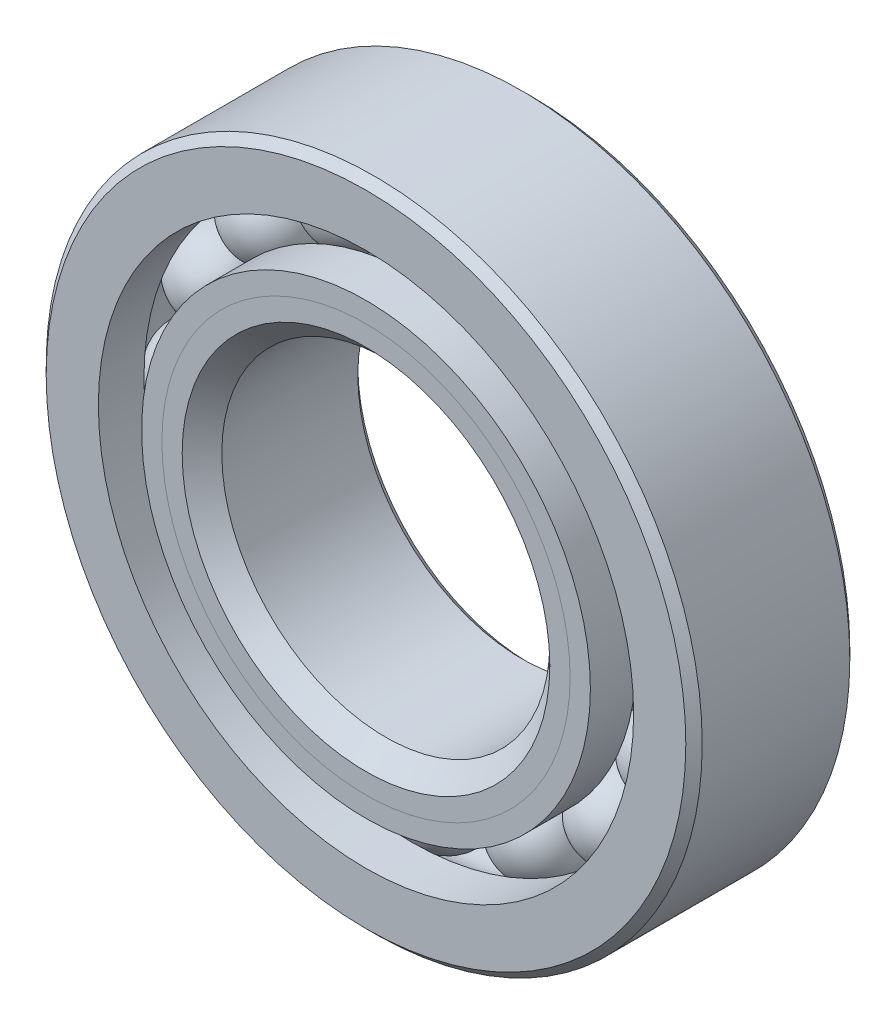
ISO-10303-21;
HEADER;
FILE_DESCRIPTION(('STEP AP214'),'2;1');
FILE_NAME('part.step','',(''),(''),'','','');
FILE_SCHEMA(('AUTOMOTIVE_DESIGN { 1 0 10303 214 1 1 1 1 }'));
ENDSEC;
DATA;
#1=APPLICATION_CONTEXT('core data for automotive mechanical design processes');
#2=APPLICATION_PROTOCOL_DEFINITION('international standard','automotive_design',2000,#1);
#3=PRODUCT_CONTEXT('',#1,'mechanical');
#4=PRODUCT('Part','Part','',(#3));
#5=PRODUCT_RELATED_PRODUCT_CATEGORY('part','',(#4));
#6=PRODUCT_DEFINITION_FORMATION('','',#4);
#7=PRODUCT_DEFINITION_CONTEXT('part definition',#1,'design');
#8=PRODUCT_DEFINITION('design','',#6,#7);
#9=PRODUCT_DEFINITION_SHAPE('','',#8);
#10=(LENGTH_UNIT() NAMED_UNIT(*) SI_UNIT(.MILLI.,.METRE.));
#11=(NAMED_UNIT(*) PLANE_ANGLE_UNIT() SI_UNIT($,.RADIAN.));
#12=(NAMED_UNIT(*) SI_UNIT($,.STERADIAN.) SOLID_ANGLE_UNIT());
#13=UNCERTAINTY_MEASURE_WITH_UNIT(LENGTH_MEASURE(1.E-05),#10,'distance_accuracy_value','');
#14=(GEOMETRIC_REPRESENTATION_CONTEXT(3) GLOBAL_UNCERTAINTY_ASSIGNED_CONTEXT((#13)) GLOBAL_UNIT_ASSIGNED_CONTEXT((#10,
#11,#12)) REPRESENTATION_CONTEXT('',''));
#15=CARTESIAN_POINT('',(0.,0.,0.));
#16=DIRECTION('',(0.,0.,1.));
#17=DIRECTION('',(1.,0.,0.));
#18=AXIS2_PLACEMENT_3D('',#15,#16,#17);
#19=CARTESIAN_POINT('',(-1.82252984663868,4.39997627358503,0.));
#20=DIRECTION('',(0.,0.,1.));
#21=DIRECTION('',(-0.382683432365077,0.923879532511292,0.));
#22=AXIS2_PLACEMENT_3D('',#19,#20,#21);
#23=SPHERICAL_SURFACE('',#22,0.820428356767388);
#24=CARTESIAN_POINT('',(-1.82252984663868,4.39997627358503,0.820428356767387));
#25=VERTEX_POINT('',#24);
#26=VERTEX_LOOP('',#25);
#27=FACE_BOUND('',#26,.T.);
#28=ADVANCED_FACE('F37',(#27),#23,.T.);
#29=CLOSED_SHELL('',(#28));
#30=MANIFOLD_SOLID_BREP('B2',#29);
#31=CARTESIAN_POINT('',(-3.36759604540089,3.36759604540097,0.));
#32=DIRECTION('',(0.,0.,1.));
#33=DIRECTION('',(-0.707106781186539,0.707106781186556,0.));
#34=AXIS2_PLACEMENT_3D('',#31,#32,#33);
#35=SPHERICAL_SURFACE('',#34,0.820428356767388);
#36=CARTESIAN_POINT('',(-3.36759604540089,3.36759604540097,0.820428356767387));
#37=VERTEX_POINT('',#36);
#38=VERTEX_LOOP('',#37);
#39=FACE_BOUND('',#38,.T.);
#40=ADVANCED_FACE('F57',(#39),#35,.T.);
#41=CLOSED_SHELL('',(#40));
#42=MANIFOLD_SOLID_BREP('B6',#41);
#43=CARTESIAN_POINT('',(-4.39997627358498,1.82252984663879,0.));
#44=DIRECTION('',(0.,0.,1.));
#45=DIRECTION('',(-0.923879532511283,0.3826834323651,0.));
#46=AXIS2_PLACEMENT_3D('',#43,#44,#45);
#47=SPHERICAL_SURFACE('',#46,0.820428356767388);
#48=CARTESIAN_POINT('',(-4.39997627358498,1.82252984663879,0.820428356767387));
#49=VERTEX_POINT('',#48);
#50=VERTEX_LOOP('',#49);
#51=FACE_BOUND('',#50,.T.);
#52=ADVANCED_FACE('F77',(#51),#47,.T.);
#53=CLOSED_SHELL('',(#52));
#54=MANIFOLD_SOLID_BREP('B33',#53);
#55=CARTESIAN_POINT('',(-4.7625,0.,0.));
#56=DIRECTION('',(0.,0.,1.));
#57=DIRECTION('',(-1.,0.,0.));
#58=AXIS2_PLACEMENT_3D('',#55,#56,#57);
#59=SPHERICAL_SURFACE('',#58,0.820428356767388);
#60=CARTESIAN_POINT('',(-4.7625,0.,0.820428356767387));
#61=VERTEX_POINT('',#60);
#62=VERTEX_LOOP('',#61);
#63=FACE_BOUND('',#62,.T.);
#64=ADVANCED_FACE('F97',(#63),#59,.T.);
#65=CLOSED_SHELL('',(#64));
#66=MANIFOLD_SOLID_BREP('B53',#65);
#67=CARTESIAN_POINT('',(-4.39997627358502,-1.8225298466387,0.));
#68=DIRECTION('',(0.,0.,1.));
#69=DIRECTION('',(-0.923879532511291,-0.382683432365081,0.));
#70=AXIS2_PLACEMENT_3D('',#67,#68,#69);
#71=SPHERICAL_SURFACE('',#70,0.820428356767388);
#72=CARTESIAN_POINT('',(-4.39997627358502,-1.8225298466387,0.820428356767387));
#73=VERTEX_POINT('',#72);
#74=VERTEX_LOOP('',#73);
#75=FACE_BOUND('',#74,.T.);
#76=ADVANCED_FACE('F119',(#75),#71,.T.);
#77=CLOSED_SHELL('',(#76));
#78=MANIFOLD_SOLID_BREP('B73',#77);
#79=CARTESIAN_POINT('',(-3.36759604540096,-3.3675960454009,0.));
#80=DIRECTION('',(0.,0.,1.));
#81=DIRECTION('',(-0.707106781186554,-0.707106781186541,0.));
#82=AXIS2_PLACEMENT_3D('',#79,#80,#81);
#83=SPHERICAL_SURFACE('',#82,0.820428356767388);
#84=CARTESIAN_POINT('',(-3.36759604540096,-3.3675960454009,0.820428356767387));
#85=VERTEX_POINT('',#84);
#86=VERTEX_LOOP('',#85);
#87=FACE_BOUND('',#86,.T.);
#88=ADVANCED_FACE('F140',(#87),#83,.T.);
#89=CLOSED_SHELL('',(#88));
#90=MANIFOLD_SOLID_BREP('B93',#89);
#91=CARTESIAN_POINT('',(-1.82252984663877,-4.39997627358499,0.));
#92=DIRECTION('',(0.,0.,1.));
#93=DIRECTION('',(-0.382683432365097,-0.923879532511284,0.));
#94=AXIS2_PLACEMENT_3D('',#91,#92,#93);
#95=SPHERICAL_SURFACE('',#94,0.820428356767388);
#96=CARTESIAN_POINT('',(-1.82252984663877,-4.39997627358499,0.820428356767387));
#97=VERTEX_POINT('',#96);
#98=VERTEX_LOOP('',#97);
#99=FACE_BOUND('',#98,.T.);
#100=ADVANCED_FACE('F161',(#99),#95,.T.);
#101=CLOSED_SHELL('',(#100));
#102=MANIFOLD_SOLID_BREP('B115',#101);
#103=CARTESIAN_POINT('',(0.,-4.7625,0.));
#104=DIRECTION('',(0.,0.,1.));
#105=DIRECTION('',(0.,-1.,0.));
#106=AXIS2_PLACEMENT_3D('',#103,#104,#105);
#107=SPHERICAL_SURFACE('',#106,0.820428356767388);
#108=CARTESIAN_POINT('',(0.,-4.7625,0.820428356767387));
#109=VERTEX_POINT('',#108);
#110=VERTEX_LOOP('',#109);
#111=FACE_BOUND('',#110,.T.);
#112=ADVANCED_FACE('F182',(#111),#107,.T.);
#113=CLOSED_SHELL('',(#112));
#114=MANIFOLD_SOLID_BREP('B136',#113);
#115=CARTESIAN_POINT('',(1.82252984663871,-4.39997627358501,0.));
#116=DIRECTION('',(0.,0.,1.));
#117=DIRECTION('',(0.382683432365084,-0.923879532511289,0.));
#118=AXIS2_PLACEMENT_3D('',#115,#116,#117);
#119=SPHERICAL_SURFACE('',#118,0.820428356767388);
#120=CARTESIAN_POINT('',(1.82252984663871,-4.39997627358501,0.820428356767387));
#121=VERTEX_POINT('',#120);
#122=VERTEX_LOOP('',#121);
#123=FACE_BOUND('',#122,.T.);
#124=ADVANCED_FACE('F203',(#123),#119,.T.);
#125=CLOSED_SHELL('',(#124));
#126=MANIFOLD_SOLID_BREP('B157',#125);
#127=CARTESIAN_POINT('',(3.36759604540091,-3.36759604540095,0.));
#128=DIRECTION('',(0.,0.,1.));
#129=DIRECTION('',(0.707106781186544,-0.707106781186551,0.));
#130=AXIS2_PLACEMENT_3D('',#127,#128,#129);
#131=SPHERICAL_SURFACE('',#130,0.820428356767388);
#132=CARTESIAN_POINT('',(3.36759604540091,-3.36759604540095,0.820428356767387));
#133=VERTEX_POINT('',#132);
#134=VERTEX_LOOP('',#133);
#135=FACE_BOUND('',#134,.T.);
#136=ADVANCED_FACE('F224',(#135),#131,.T.);
#137=CLOSED_SHELL('',(#136));
#138=MANIFOLD_SOLID_BREP('B178',#137);
#139=CARTESIAN_POINT('',(4.399976273585,-1.82252984663876,0.));
#140=DIRECTION('',(0.,0.,1.));
#141=DIRECTION('',(0.923879532511285,-0.382683432365094,0.));
#142=AXIS2_PLACEMENT_3D('',#139,#140,#141);
#143=SPHERICAL_SURFACE('',#142,0.820428356767388);
#144=CARTESIAN_POINT('',(4.399976273585,-1.82252984663876,0.820428356767387));
#145=VERTEX_POINT('',#144);
#146=VERTEX_LOOP('',#145);
#147=FACE_BOUND('',#146,.T.);
#148=ADVANCED_FACE('F245',(#147),#143,.T.);
#149=CLOSED_SHELL('',(#148));
#150=MANIFOLD_SOLID_BREP('B199',#149);
#151=CARTESIAN_POINT('',(4.7625,0.,0.));
#152=DIRECTION('',(0.,0.,1.));
#153=DIRECTION('',(1.,0.,0.));
#154=AXIS2_PLACEMENT_3D('',#151,#152,#153);
#155=SPHERICAL_SURFACE('',#154,0.820428356767388);
#156=CARTESIAN_POINT('',(4.7625,0.,0.820428356767387));
#157=VERTEX_POINT('',#156);
#158=VERTEX_LOOP('',#157);
#159=FACE_BOUND('',#158,.T.);
#160=ADVANCED_FACE('F266',(#159),#155,.T.);
#161=CLOSED_SHELL('',(#160));
#162=MANIFOLD_SOLID_BREP('B220',#161);
#163=CARTESIAN_POINT('',(4.39997627358501,1.82252984663873,0.));
#164=DIRECTION('',(0.,0.,1.));
#165=DIRECTION('',(0.923879532511288,0.382683432365087,0.));
#166=AXIS2_PLACEMENT_3D('',#163,#164,#165);
#167=SPHERICAL_SURFACE('',#166,0.820428356767388);
#168=CARTESIAN_POINT('',(4.39997627358501,1.82252984663873,0.820428356767387));
#169=VERTEX_POINT('',#168);
#170=VERTEX_LOOP('',#169);
#171=FACE_BOUND('',#170,.T.);
#172=ADVANCED_FACE('F287',(#171),#167,.T.);
#173=CLOSED_SHELL('',(#172));
#174=MANIFOLD_SOLID_BREP('B241',#173);
#175=CARTESIAN_POINT('',(3.36759604540094,3.36759604540093,0.));
#176=DIRECTION('',(0.,0.,1.));
#177=DIRECTION('',(0.707106781186549,0.707106781186546,0.));
#178=AXIS2_PLACEMENT_3D('',#175,#176,#177);
#179=SPHERICAL_SURFACE('',#178,0.820428356767388);
#180=CARTESIAN_POINT('',(3.36759604540094,3.36759604540093,0.820428356767387));
#181=VERTEX_POINT('',#180);
#182=VERTEX_LOOP('',#181);
#183=FACE_BOUND('',#182,.T.);
#184=ADVANCED_FACE('F308',(#183),#179,.T.);
#185=CLOSED_SHELL('',(#184));
#186=MANIFOLD_SOLID_BREP('B262',#185);
#187=CARTESIAN_POINT('',(1.82252984663874,4.399976273585,0.));
#188=DIRECTION('',(0.,0.,1.));
#189=DIRECTION('',(0.382683432365091,0.923879532511287,0.));
#190=AXIS2_PLACEMENT_3D('',#187,#188,#189);
#191=SPHERICAL_SURFACE('',#190,0.820428356767388);
#192=CARTESIAN_POINT('',(1.82252984663874,4.399976273585,0.820428356767387));
#193=VERTEX_POINT('',#192);
#194=VERTEX_LOOP('',#193);
#195=FACE_BOUND('',#194,.T.);
#196=ADVANCED_FACE('F329',(#195),#191,.T.);
#197=CLOSED_SHELL('',(#196));
#198=MANIFOLD_SOLID_BREP('B283',#197);
#199=CARTESIAN_POINT('',(0.,4.7625,0.));
#200=DIRECTION('',(0.,0.,1.));
#201=DIRECTION('',(0.,1.,0.));
#202=AXIS2_PLACEMENT_3D('',#199,#200,#201);
#203=SPHERICAL_SURFACE('',#202,0.820428356767388);
#204=CARTESIAN_POINT('',(0.,4.7625,0.820428356767387));
#205=VERTEX_POINT('',#204);
#206=VERTEX_LOOP('',#205);
#207=FACE_BOUND('',#206,.T.);
#208=ADVANCED_FACE('F351',(#207),#203,.T.);
#209=CLOSED_SHELL('',(#208));
#210=MANIFOLD_SOLID_BREP('B304',#209);
#211=CARTESIAN_POINT('',(0.,3.95117725146749,1.5875));
#212=DIRECTION('',(0.,0.,-1.));
#213=DIRECTION('',(-1.,0.,0.));
#214=AXIS2_PLACEMENT_3D('',#211,#212,#213);
#215=PLANE('',#214);
#216=CARTESIAN_POINT('',(0.,0.,1.5875));
#217=DIRECTION('',(0.,0.,1.));
#218=DIRECTION('',(1.,0.,0.));
#219=AXIS2_PLACEMENT_3D('',#216,#217,#218);
#220=CIRCLE('',#219,3.55853582161631);
#221=CARTESIAN_POINT('',(3.55853582161631,0.,1.5875));
#222=VERTEX_POINT('',#221);
#223=EDGE_CURVE('E406',#222,#222,#220,.T.);
#224=ORIENTED_EDGE('',*,*,#223,.F.);
#225=EDGE_LOOP('',(#224));
#226=FACE_BOUND('',#225,.T.);
#227=CARTESIAN_POINT('',(0.,0.,1.5875));
#228=DIRECTION('',(0.,0.,1.));
#229=DIRECTION('',(1.,0.,0.));
#230=AXIS2_PLACEMENT_3D('',#227,#228,#229);
#231=CIRCLE('',#230,3.95117725146749);
#232=CARTESIAN_POINT('',(3.95117725146749,0.,1.5875));
#233=VERTEX_POINT('',#232);
#234=EDGE_CURVE('E350',#233,#233,#231,.T.);
#235=ORIENTED_EDGE('',*,*,#234,.T.);
#236=EDGE_LOOP('',(#235));
#237=FACE_BOUND('',#236,.T.);
#238=ADVANCED_FACE('F372',(#226,#237),#215,.F.);
#239=CARTESIAN_POINT('',(0.,0.,1.19485857014881));
#240=DIRECTION('',(0.,0.,1.));
#241=DIRECTION('',(1.,0.,0.));
#242=AXIS2_PLACEMENT_3D('',#239,#240,#241);
#243=CONICAL_SURFACE('',#242,3.55853582161631,0.78539816339745);
#244=ORIENTED_EDGE('',*,*,#234,.F.);
#245=EDGE_LOOP('',(#244));
#246=FACE_BOUND('',#245,.T.);
#247=CARTESIAN_POINT('',(0.,0.,1.19485857014881));
#248=DIRECTION('',(0.,0.,1.));
#249=DIRECTION('',(1.,0.,0.));
#250=AXIS2_PLACEMENT_3D('',#247,#248,#249);
#251=CIRCLE('',#250,3.55853582161631);
#252=CARTESIAN_POINT('',(3.55853582161631,0.,1.19485857014881));
#253=VERTEX_POINT('',#252);
#254=EDGE_CURVE('E378',#253,#253,#251,.T.);
#255=ORIENTED_EDGE('',*,*,#254,.T.);
#256=EDGE_LOOP('',(#255));
#257=FACE_BOUND('',#256,.T.);
#258=ADVANCED_FACE('F413',(#246,#257),#243,.T.);
#259=CARTESIAN_POINT('',(0.,0.,1.5875));
#260=DIRECTION('',(0.,0.,1.));
#261=DIRECTION('',(1.,0.,0.));
#262=AXIS2_PLACEMENT_3D('',#259,#260,#261);
#263=CYLINDRICAL_SURFACE('',#262,3.55853582161631);
#264=ORIENTED_EDGE('',*,*,#254,.F.);
#265=EDGE_LOOP('',(#264));
#266=FACE_BOUND('',#265,.T.);
#267=CARTESIAN_POINT('',(0.,0.,0.));
#268=DIRECTION('',(0.,0.,1.));
#269=DIRECTION('',(1.,0.,0.));
#270=AXIS2_PLACEMENT_3D('',#267,#268,#269);
#271=CIRCLE('',#270,3.55853582161631);
#272=CARTESIAN_POINT('',(3.55853582161631,0.,0.));
#273=VERTEX_POINT('',#272);
#274=EDGE_CURVE('E382',#273,#273,#271,.T.);
#275=ORIENTED_EDGE('',*,*,#274,.T.);
#276=EDGE_LOOP('',(#275));
#277=FACE_BOUND('',#276,.T.);
#278=ADVANCED_FACE('F417',(#266,#277),#263,.T.);
#279=CARTESIAN_POINT('',(0.,3.55853582161631,0.));
#280=DIRECTION('',(0.,0.,-1.));
#281=DIRECTION('',(-1.,0.,0.));
#282=AXIS2_PLACEMENT_3D('',#279,#280,#281);
#283=PLANE('',#282);
#284=ORIENTED_EDGE('',*,*,#274,.F.);
#285=EDGE_LOOP('',(#284));
#286=FACE_BOUND('',#285,.T.);
#287=CARTESIAN_POINT('',(0.,0.,0.));
#288=DIRECTION('',(0.,0.,1.));
#289=DIRECTION('',(1.,0.,0.));
#290=AXIS2_PLACEMENT_3D('',#287,#288,#289);
#291=CIRCLE('',#290,3.94207164323261);
#292=CARTESIAN_POINT('',(3.94207164323261,0.,0.));
#293=VERTEX_POINT('',#292);
#294=EDGE_CURVE('E386',#293,#293,#291,.T.);
#295=ORIENTED_EDGE('',*,*,#294,.T.);
#296=EDGE_LOOP('',(#295));
#297=FACE_BOUND('',#296,.T.);
#298=ADVANCED_FACE('F422',(#286,#297),#283,.F.);
#299=CARTESIAN_POINT('',(0.,0.,0.));
#300=DIRECTION('',(0.,0.,1.));
#301=DIRECTION('',(1.,0.,0.));
#302=AXIS2_PLACEMENT_3D('',#299,#300,#301);
#303=TOROIDAL_SURFACE('',#302,4.7625,0.820428356767388);
#304=ORIENTED_EDGE('',*,*,#294,.F.);
#305=EDGE_LOOP('',(#304));
#306=FACE_BOUND('',#305,.T.);
#307=CARTESIAN_POINT('',(0.,0.,-0.705555555555556));
#308=DIRECTION('',(0.,0.,1.));
#309=DIRECTION('',(1.,0.,0.));
#310=AXIS2_PLACEMENT_3D('',#307,#308,#309);
#311=CIRCLE('',#310,4.34381868131868);
#312=CARTESIAN_POINT('',(4.34381868131868,0.,-0.705555555555556));
#313=VERTEX_POINT('',#312);
#314=EDGE_CURVE('E391',#313,#313,#311,.T.);
#315=ORIENTED_EDGE('',*,*,#314,.T.);
#316=EDGE_LOOP('',(#315));
#317=FACE_BOUND('',#316,.T.);
#318=ADVANCED_FACE('F428',(#306,#317),#303,.F.);
#319=CARTESIAN_POINT('',(0.,0.,1.5875));
#320=DIRECTION('',(0.,0.,1.));
#321=DIRECTION('',(1.,0.,0.));
#322=AXIS2_PLACEMENT_3D('',#319,#320,#321);
#323=CYLINDRICAL_SURFACE('',#322,4.34381868131868);
#324=ORIENTED_EDGE('',*,*,#314,.F.);
#325=EDGE_LOOP('',(#324));
#326=FACE_BOUND('',#325,.T.);
#327=CARTESIAN_POINT('',(0.,0.,-1.5875));
#328=DIRECTION('',(0.,0.,1.));
#329=DIRECTION('',(1.,0.,0.));
#330=AXIS2_PLACEMENT_3D('',#327,#328,#329);
#331=CIRCLE('',#330,4.34381868131868);
#332=CARTESIAN_POINT('',(4.34381868131868,0.,-1.5875));
#333=VERTEX_POINT('',#332);
#334=EDGE_CURVE('E394',#333,#333,#331,.T.);
#335=ORIENTED_EDGE('',*,*,#334,.T.);
#336=EDGE_LOOP('',(#335));
#337=FACE_BOUND('',#336,.T.);
#338=ADVANCED_FACE('F432',(#326,#337),#323,.T.);
#339=CARTESIAN_POINT('',(0.,3.33375,-1.5875));
#340=DIRECTION('',(0.,0.,1.));
#341=DIRECTION('',(1.,0.,0.));
#342=AXIS2_PLACEMENT_3D('',#339,#340,#341);
#343=PLANE('',#342);
#344=ORIENTED_EDGE('',*,*,#334,.F.);
#345=EDGE_LOOP('',(#344));
#346=FACE_BOUND('',#345,.T.);
#347=CARTESIAN_POINT('',(0.,0.,-1.5875));
#348=DIRECTION('',(0.,0.,1.));
#349=DIRECTION('',(1.,0.,0.));
#350=AXIS2_PLACEMENT_3D('',#347,#348,#349);
#351=CIRCLE('',#350,3.33375);
#352=CARTESIAN_POINT('',(3.33375,0.,-1.5875));
#353=VERTEX_POINT('',#352);
#354=EDGE_CURVE('E397',#353,#353,#351,.T.);
#355=ORIENTED_EDGE('',*,*,#354,.T.);
#356=EDGE_LOOP('',(#355));
#357=FACE_BOUND('',#356,.T.);
#358=ADVANCED_FACE('F436',(#346,#357),#343,.F.);
#359=CARTESIAN_POINT('',(0.,0.,-1.42875));
#360=DIRECTION('',(0.,0.,-1.));
#361=DIRECTION('',(-1.,0.,0.));
#362=AXIS2_PLACEMENT_3D('',#359,#360,#361);
#363=CONICAL_SURFACE('',#362,3.175,0.785398163397448);
#364=ORIENTED_EDGE('',*,*,#354,.F.);
#365=EDGE_LOOP('',(#364));
#366=FACE_BOUND('',#365,.T.);
#367=CARTESIAN_POINT('',(0.,0.,-1.42875));
#368=DIRECTION('',(0.,0.,1.));
#369=DIRECTION('',(1.,0.,0.));
#370=AXIS2_PLACEMENT_3D('',#367,#368,#369);
#371=CIRCLE('',#370,3.175);
#372=CARTESIAN_POINT('',(3.175,0.,-1.42875));
#373=VERTEX_POINT('',#372);
#374=EDGE_CURVE('E400',#373,#373,#371,.T.);
#375=ORIENTED_EDGE('',*,*,#374,.T.);
#376=EDGE_LOOP('',(#375));
#377=FACE_BOUND('',#376,.T.);
#378=ADVANCED_FACE('F440',(#366,#377),#363,.F.);
#379=CARTESIAN_POINT('',(0.,0.,1.5875));
#380=DIRECTION('',(0.,0.,1.));
#381=DIRECTION('',(1.,0.,0.));
#382=AXIS2_PLACEMENT_3D('',#379,#380,#381);
#383=CYLINDRICAL_SURFACE('',#382,3.175);
#384=ORIENTED_EDGE('',*,*,#374,.F.);
#385=EDGE_LOOP('',(#384));
#386=FACE_BOUND('',#385,.T.);
#387=CARTESIAN_POINT('',(0.,0.,1.2039641783837));
#388=DIRECTION('',(0.,0.,1.));
#389=DIRECTION('',(1.,0.,0.));
#390=AXIS2_PLACEMENT_3D('',#387,#388,#389);
#391=CIRCLE('',#390,3.175);
#392=CARTESIAN_POINT('',(3.175,0.,1.2039641783837));
#393=VERTEX_POINT('',#392);
#394=EDGE_CURVE('E403',#393,#393,#391,.T.);
#395=ORIENTED_EDGE('',*,*,#394,.T.);
#396=EDGE_LOOP('',(#395));
#397=FACE_BOUND('',#396,.T.);
#398=ADVANCED_FACE('F444',(#386,#397),#383,.F.);
#399=CARTESIAN_POINT('',(0.,0.,1.5875));
#400=DIRECTION('',(0.,0.,1.));
#401=DIRECTION('',(1.,0.,0.));
#402=AXIS2_PLACEMENT_3D('',#399,#400,#401);
#403=CONICAL_SURFACE('',#402,3.55853582161631,0.78539816339745);
#404=ORIENTED_EDGE('',*,*,#394,.F.);
#405=EDGE_LOOP('',(#404));
#406=FACE_BOUND('',#405,.T.);
#407=ORIENTED_EDGE('',*,*,#223,.T.);
#408=EDGE_LOOP('',(#407));
#409=FACE_BOUND('',#408,.T.);
#410=ADVANCED_FACE('F410',(#406,#409),#403,.F.);
#411=CLOSED_SHELL('',(#238,#258,#278,#298,#318,#338,#358,#378,#398,#410));
#412=MANIFOLD_SOLID_BREP('B325',#411);
#413=CARTESIAN_POINT('',(0.,4.34381868131868,1.5875));
#414=DIRECTION('',(0.,0.,-1.));
#415=DIRECTION('',(-1.,0.,0.));
#416=AXIS2_PLACEMENT_3D('',#413,#414,#415);
#417=PLANE('',#416);
#418=CARTESIAN_POINT('',(0.,0.,1.5875));
#419=DIRECTION('',(0.,0.,1.));
#420=DIRECTION('',(1.,0.,0.));
#421=AXIS2_PLACEMENT_3D('',#418,#419,#420);
#422=CIRCLE('',#421,3.95117725146749);
#423=CARTESIAN_POINT('',(3.95117725146749,0.,1.5875));
#424=VERTEX_POINT('',#423);
#425=EDGE_CURVE('E371',#424,#424,#422,.T.);
#426=ORIENTED_EDGE('',*,*,#425,.F.);
#427=EDGE_LOOP('',(#426));
#428=FACE_BOUND('',#427,.T.);
#429=CARTESIAN_POINT('',(0.,0.,1.5875));
#430=DIRECTION('',(0.,0.,1.));
#431=DIRECTION('',(1.,0.,0.));
#432=AXIS2_PLACEMENT_3D('',#429,#430,#431);
#433=CIRCLE('',#432,4.34381868131868);
#434=CARTESIAN_POINT('',(4.34381868131868,0.,1.5875));
#435=VERTEX_POINT('',#434);
#436=EDGE_CURVE('E553',#435,#435,#433,.T.);
#437=ORIENTED_EDGE('',*,*,#436,.T.);
#438=EDGE_LOOP('',(#437));
#439=FACE_BOUND('',#438,.T.);
#440=ADVANCED_FACE('F531',(#428,#439),#417,.F.);
#441=CARTESIAN_POINT('',(0.,0.,1.5875));
#442=DIRECTION('',(0.,0.,1.));
#443=DIRECTION('',(1.,0.,0.));
#444=AXIS2_PLACEMENT_3D('',#441,#442,#443);
#445=CONICAL_SURFACE('',#444,3.95117725146749,0.78539816339745);
#446=CARTESIAN_POINT('',(0.,0.,1.19485857014881));
#447=DIRECTION('',(0.,0.,1.));
#448=DIRECTION('',(1.,0.,0.));
#449=AXIS2_PLACEMENT_3D('',#446,#447,#448);
#450=CIRCLE('',#449,3.55853582161631);
#451=CARTESIAN_POINT('',(3.55853582161631,0.,1.19485857014881));
#452=VERTEX_POINT('',#451);
#453=EDGE_CURVE('E537',#452,#452,#450,.T.);
#454=ORIENTED_EDGE('',*,*,#453,.F.);
#455=EDGE_LOOP('',(#454));
#456=FACE_BOUND('',#455,.T.);
#457=ORIENTED_EDGE('',*,*,#425,.T.);
#458=EDGE_LOOP('',(#457));
#459=FACE_BOUND('',#458,.T.);
#460=ADVANCED_FACE('F578',(#456,#459),#445,.F.);
#461=CARTESIAN_POINT('',(0.,0.,1.5875));
#462=DIRECTION('',(0.,0.,1.));
#463=DIRECTION('',(1.,0.,0.));
#464=AXIS2_PLACEMENT_3D('',#461,#462,#463);
#465=CYLINDRICAL_SURFACE('',#464,3.55853582161631);
#466=CARTESIAN_POINT('',(0.,0.,0.));
#467=DIRECTION('',(0.,0.,1.));
#468=DIRECTION('',(1.,0.,0.));
#469=AXIS2_PLACEMENT_3D('',#466,#467,#468);
#470=CIRCLE('',#469,3.55853582161631);
#471=CARTESIAN_POINT('',(3.55853582161631,0.,0.));
#472=VERTEX_POINT('',#471);
#473=EDGE_CURVE('E541',#472,#472,#470,.T.);
#474=ORIENTED_EDGE('',*,*,#473,.F.);
#475=EDGE_LOOP('',(#474));
#476=FACE_BOUND('',#475,.T.);
#477=ORIENTED_EDGE('',*,*,#453,.T.);
#478=EDGE_LOOP('',(#477));
#479=FACE_BOUND('',#478,.T.);
#480=ADVANCED_FACE('F573',(#476,#479),#465,.F.);
#481=CARTESIAN_POINT('',(0.,3.55853582161631,0.));
#482=DIRECTION('',(0.,0.,1.));
#483=DIRECTION('',(1.,0.,0.));
#484=AXIS2_PLACEMENT_3D('',#481,#482,#483);
#485=PLANE('',#484);
#486=CARTESIAN_POINT('',(0.,0.,0.));
#487=DIRECTION('',(0.,0.,1.));
#488=DIRECTION('',(1.,0.,0.));
#489=AXIS2_PLACEMENT_3D('',#486,#487,#488);
#490=CIRCLE('',#489,3.94207164323261);
#491=CARTESIAN_POINT('',(3.94207164323261,0.,0.));
#492=VERTEX_POINT('',#491);
#493=EDGE_CURVE('E545',#492,#492,#490,.T.);
#494=ORIENTED_EDGE('',*,*,#493,.F.);
#495=EDGE_LOOP('',(#494));
#496=FACE_BOUND('',#495,.T.);
#497=ORIENTED_EDGE('',*,*,#473,.T.);
#498=EDGE_LOOP('',(#497));
#499=FACE_BOUND('',#498,.T.);
#500=ADVANCED_FACE('F567',(#496,#499),#485,.F.);
#501=CARTESIAN_POINT('',(0.,0.,0.));
#502=DIRECTION('',(0.,0.,1.));
#503=DIRECTION('',(1.,0.,0.));
#504=AXIS2_PLACEMENT_3D('',#501,#502,#503);
#505=TOROIDAL_SURFACE('',#504,4.7625,0.820428356767388);
#506=CARTESIAN_POINT('',(0.,0.,0.705555555555555));
#507=DIRECTION('',(0.,0.,1.));
#508=DIRECTION('',(1.,0.,0.));
#509=AXIS2_PLACEMENT_3D('',#506,#507,#508);
#510=CIRCLE('',#509,4.34381868131868);
#511=CARTESIAN_POINT('',(4.34381868131868,0.,0.705555555555555));
#512=VERTEX_POINT('',#511);
#513=EDGE_CURVE('E550',#512,#512,#510,.T.);
#514=ORIENTED_EDGE('',*,*,#513,.F.);
#515=EDGE_LOOP('',(#514));
#516=FACE_BOUND('',#515,.T.);
#517=ORIENTED_EDGE('',*,*,#493,.T.);
#518=EDGE_LOOP('',(#517));
#519=FACE_BOUND('',#518,.T.);
#520=ADVANCED_FACE('F561',(#516,#519),#505,.F.);
#521=CARTESIAN_POINT('',(0.,0.,1.5875));
#522=DIRECTION('',(0.,0.,1.));
#523=DIRECTION('',(1.,0.,0.));
#524=AXIS2_PLACEMENT_3D('',#521,#522,#523);
#525=CYLINDRICAL_SURFACE('',#524,4.34381868131868);
#526=ORIENTED_EDGE('',*,*,#436,.F.);
#527=EDGE_LOOP('',(#526));
#528=FACE_BOUND('',#527,.T.);
#529=ORIENTED_EDGE('',*,*,#513,.T.);
#530=EDGE_LOOP('',(#529));
#531=FACE_BOUND('',#530,.T.);
#532=ADVANCED_FACE('F558',(#528,#531),#525,.T.);
#533=CLOSED_SHELL('',(#440,#460,#480,#500,#520,#532));
#534=MANIFOLD_SOLID_BREP('B345',#533);
#535=CARTESIAN_POINT('',(0.,0.,1.42875));
#536=DIRECTION('',(0.,0.,-1.));
#537=DIRECTION('',(-1.,0.,0.));
#538=AXIS2_PLACEMENT_3D('',#535,#536,#537);
#539=CONICAL_SURFACE('',#538,6.35,0.785398163397448);
#540=CARTESIAN_POINT('',(0.,0.,1.5875));
#541=DIRECTION('',(0.,0.,1.));
#542=DIRECTION('',(1.,0.,0.));
#543=AXIS2_PLACEMENT_3D('',#540,#541,#542);
#544=CIRCLE('',#543,6.19125);
#545=CARTESIAN_POINT('',(6.19125,0.,1.5875));
#546=VERTEX_POINT('',#545);
#547=EDGE_CURVE('E651',#546,#546,#544,.T.);
#548=ORIENTED_EDGE('',*,*,#547,.F.);
#549=EDGE_LOOP('',(#548));
#550=FACE_BOUND('',#549,.T.);
#551=CARTESIAN_POINT('',(0.,0.,1.42875));
#552=DIRECTION('',(0.,0.,1.));
#553=DIRECTION('',(1.,0.,0.));
#554=AXIS2_PLACEMENT_3D('',#551,#552,#553);
#555=CIRCLE('',#554,6.35);
#556=CARTESIAN_POINT('',(6.35,0.,1.42875));
#557=VERTEX_POINT('',#556);
#558=EDGE_CURVE('E530',#557,#557,#555,.T.);
#559=ORIENTED_EDGE('',*,*,#558,.T.);
#560=EDGE_LOOP('',(#559));
#561=FACE_BOUND('',#560,.T.);
#562=ADVANCED_FACE('F623',(#550,#561),#539,.T.);
#563=CARTESIAN_POINT('',(0.,0.,1.5875));
#564=DIRECTION('',(0.,0.,1.));
#565=DIRECTION('',(1.,0.,0.));
#566=AXIS2_PLACEMENT_3D('',#563,#564,#565);
#567=CYLINDRICAL_SURFACE('',#566,6.35);
#568=ORIENTED_EDGE('',*,*,#558,.F.);
#569=EDGE_LOOP('',(#568));
#570=FACE_BOUND('',#569,.T.);
#571=CARTESIAN_POINT('',(0.,0.,-1.42875));
#572=DIRECTION('',(0.,0.,1.));
#573=DIRECTION('',(1.,0.,0.));
#574=AXIS2_PLACEMENT_3D('',#571,#572,#573);
#575=CIRCLE('',#574,6.35);
#576=CARTESIAN_POINT('',(6.35,0.,-1.42875));
#577=VERTEX_POINT('',#576);
#578=EDGE_CURVE('E629',#577,#577,#575,.T.);
#579=ORIENTED_EDGE('',*,*,#578,.T.);
#580=EDGE_LOOP('',(#579));
#581=FACE_BOUND('',#580,.T.);
#582=ADVANCED_FACE('F658',(#570,#581),#567,.T.);
#583=CARTESIAN_POINT('',(0.,0.,-1.5875));
#584=DIRECTION('',(0.,0.,1.));
#585=DIRECTION('',(1.,0.,0.));
#586=AXIS2_PLACEMENT_3D('',#583,#584,#585);
#587=CONICAL_SURFACE('',#586,6.19125,0.785398163397448);
#588=ORIENTED_EDGE('',*,*,#578,.F.);
#589=EDGE_LOOP('',(#588));
#590=FACE_BOUND('',#589,.T.);
#591=CARTESIAN_POINT('',(0.,0.,-1.5875));
#592=DIRECTION('',(0.,0.,1.));
#593=DIRECTION('',(1.,0.,0.));
#594=AXIS2_PLACEMENT_3D('',#591,#592,#593);
#595=CIRCLE('',#594,6.19125);
#596=CARTESIAN_POINT('',(6.19125,0.,-1.5875));
#597=VERTEX_POINT('',#596);
#598=EDGE_CURVE('E633',#597,#597,#595,.T.);
#599=ORIENTED_EDGE('',*,*,#598,.T.);
#600=EDGE_LOOP('',(#599));
#601=FACE_BOUND('',#600,.T.);
#602=ADVANCED_FACE('F662',(#590,#601),#587,.T.);
#603=CARTESIAN_POINT('',(0.,6.19125,-1.5875));
#604=DIRECTION('',(0.,0.,1.));
#605=DIRECTION('',(1.,0.,0.));
#606=AXIS2_PLACEMENT_3D('',#603,#604,#605);
#607=PLANE('',#606);
#608=ORIENTED_EDGE('',*,*,#598,.F.);
#609=EDGE_LOOP('',(#608));
#610=FACE_BOUND('',#609,.T.);
#611=CARTESIAN_POINT('',(0.,0.,-1.5875));
#612=DIRECTION('',(0.,0.,1.));
#613=DIRECTION('',(1.,0.,0.));
#614=AXIS2_PLACEMENT_3D('',#611,#612,#613);
#615=CIRCLE('',#614,5.18118131868132);
#616=CARTESIAN_POINT('',(5.18118131868132,0.,-1.5875));
#617=VERTEX_POINT('',#616);
#618=EDGE_CURVE('E637',#617,#617,#615,.T.);
#619=ORIENTED_EDGE('',*,*,#618,.T.);
#620=EDGE_LOOP('',(#619));
#621=FACE_BOUND('',#620,.T.);
#622=ADVANCED_FACE('F667',(#610,#621),#607,.F.);
#623=CARTESIAN_POINT('',(0.,0.,1.5875));
#624=DIRECTION('',(0.,0.,1.));
#625=DIRECTION('',(1.,0.,0.));
#626=AXIS2_PLACEMENT_3D('',#623,#624,#625);
#627=CYLINDRICAL_SURFACE('',#626,5.18118131868132);
#628=ORIENTED_EDGE('',*,*,#618,.F.);
#629=EDGE_LOOP('',(#628));
#630=FACE_BOUND('',#629,.T.);
#631=CARTESIAN_POINT('',(0.,0.,-0.705555555555556));
#632=DIRECTION('',(0.,0.,1.));
#633=DIRECTION('',(1.,0.,0.));
#634=AXIS2_PLACEMENT_3D('',#631,#632,#633);
#635=CIRCLE('',#634,5.18118131868132);
#636=CARTESIAN_POINT('',(5.18118131868132,0.,-0.705555555555556));
#637=VERTEX_POINT('',#636);
#638=EDGE_CURVE('E642',#637,#637,#635,.T.);
#639=ORIENTED_EDGE('',*,*,#638,.T.);
#640=EDGE_LOOP('',(#639));
#641=FACE_BOUND('',#640,.T.);
#642=ADVANCED_FACE('F673',(#630,#641),#627,.F.);
#643=CARTESIAN_POINT('',(0.,0.,0.));
#644=DIRECTION('',(0.,0.,1.));
#645=DIRECTION('',(1.,0.,0.));
#646=AXIS2_PLACEMENT_3D('',#643,#644,#645);
#647=TOROIDAL_SURFACE('',#646,4.7625,0.820428356767388);
#648=ORIENTED_EDGE('',*,*,#638,.F.);
#649=EDGE_LOOP('',(#648));
#650=FACE_BOUND('',#649,.T.);
#651=CARTESIAN_POINT('',(0.,0.,0.705555555555555));
#652=DIRECTION('',(0.,0.,1.));
#653=DIRECTION('',(1.,0.,0.));
#654=AXIS2_PLACEMENT_3D('',#651,#652,#653);
#655=CIRCLE('',#654,5.18118131868132);
#656=CARTESIAN_POINT('',(5.18118131868132,0.,0.705555555555555));
#657=VERTEX_POINT('',#656);
#658=EDGE_CURVE('E645',#657,#657,#655,.T.);
#659=ORIENTED_EDGE('',*,*,#658,.T.);
#660=EDGE_LOOP('',(#659));
#661=FACE_BOUND('',#660,.T.);
#662=ADVANCED_FACE('F677',(#650,#661),#647,.F.);
#663=CARTESIAN_POINT('',(0.,0.,1.5875));
#664=DIRECTION('',(0.,0.,1.));
#665=DIRECTION('',(1.,0.,0.));
#666=AXIS2_PLACEMENT_3D('',#663,#664,#665);
#667=CYLINDRICAL_SURFACE('',#666,5.18118131868132);
#668=ORIENTED_EDGE('',*,*,#658,.F.);
#669=EDGE_LOOP('',(#668));
#670=FACE_BOUND('',#669,.T.);
#671=CARTESIAN_POINT('',(0.,0.,1.5875));
#672=DIRECTION('',(0.,0.,1.));
#673=DIRECTION('',(1.,0.,0.));
#674=AXIS2_PLACEMENT_3D('',#671,#672,#673);
#675=CIRCLE('',#674,5.18118131868132);
#676=CARTESIAN_POINT('',(5.18118131868132,0.,1.5875));
#677=VERTEX_POINT('',#676);
#678=EDGE_CURVE('E648',#677,#677,#675,.T.);
#679=ORIENTED_EDGE('',*,*,#678,.T.);
#680=EDGE_LOOP('',(#679));
#681=FACE_BOUND('',#680,.T.);
#682=ADVANCED_FACE('F681',(#670,#681),#667,.F.);
#683=CARTESIAN_POINT('',(0.,6.19125,1.5875));
#684=DIRECTION('',(0.,0.,-1.));
#685=DIRECTION('',(-1.,0.,0.));
#686=AXIS2_PLACEMENT_3D('',#683,#684,#685);
#687=PLANE('',#686);
#688=ORIENTED_EDGE('',*,*,#678,.F.);
#689=EDGE_LOOP('',(#688));
#690=FACE_BOUND('',#689,.T.);
#691=ORIENTED_EDGE('',*,*,#547,.T.);
#692=EDGE_LOOP('',(#691));
#693=FACE_BOUND('',#692,.T.);
#694=ADVANCED_FACE('F655',(#690,#693),#687,.F.);
#695=CLOSED_SHELL('',(#562,#582,#602,#622,#642,#662,#682,#694));
#696=MANIFOLD_SOLID_BREP('B366',#695);
#697=ADVANCED_BREP_SHAPE_REPRESENTATION('',(#18,#30,#42,#54,#66,#78,#90,#102,#114,#126,#138,
#150,#162,#174,#186,#198,#210,#412,#534,#696),#14);
#698=SHAPE_DEFINITION_REPRESENTATION(#9,#697);
ENDSEC;
END-ISO-10303-21;
